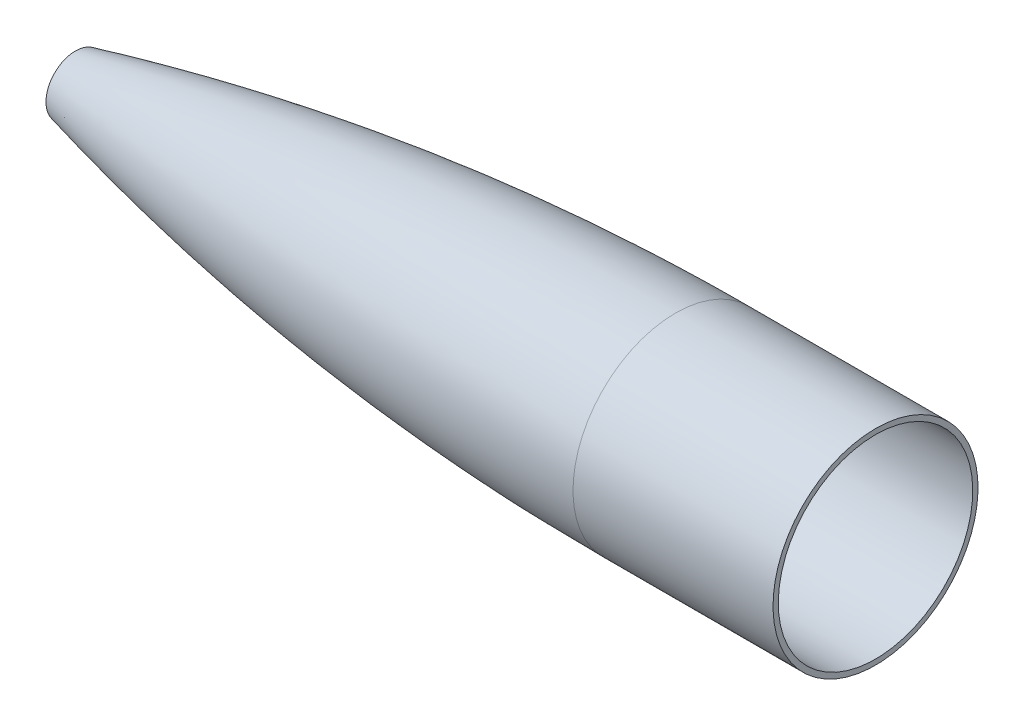
ISO-10303-21;
HEADER;
FILE_DESCRIPTION(('STEP AP214'),'2;1');
FILE_NAME('part.step','',(''),(''),'','','');
FILE_SCHEMA(('AUTOMOTIVE_DESIGN { 1 0 10303 214 1 1 1 1 }'));
ENDSEC;
DATA;
#1=APPLICATION_CONTEXT('core data for automotive mechanical design processes');
#2=APPLICATION_PROTOCOL_DEFINITION('international standard','automotive_design',2000,#1);
#3=PRODUCT_CONTEXT('',#1,'mechanical');
#4=PRODUCT('Part','Part','',(#3));
#5=PRODUCT_RELATED_PRODUCT_CATEGORY('part','',(#4));
#6=PRODUCT_DEFINITION_FORMATION('','',#4);
#7=PRODUCT_DEFINITION_CONTEXT('part definition',#1,'design');
#8=PRODUCT_DEFINITION('design','',#6,#7);
#9=PRODUCT_DEFINITION_SHAPE('','',#8);
#10=(LENGTH_UNIT() NAMED_UNIT(*) SI_UNIT(.MILLI.,.METRE.));
#11=(NAMED_UNIT(*) PLANE_ANGLE_UNIT() SI_UNIT($,.RADIAN.));
#12=(NAMED_UNIT(*) SI_UNIT($,.STERADIAN.) SOLID_ANGLE_UNIT());
#13=UNCERTAINTY_MEASURE_WITH_UNIT(LENGTH_MEASURE(1.E-05),#10,'distance_accuracy_value','');
#14=(GEOMETRIC_REPRESENTATION_CONTEXT(3) GLOBAL_UNCERTAINTY_ASSIGNED_CONTEXT((#13)) GLOBAL_UNIT_ASSIGNED_CONTEXT((#10,
#11,#12)) REPRESENTATION_CONTEXT('',''));
#15=CARTESIAN_POINT('',(0.,0.,0.));
#16=DIRECTION('',(0.,0.,1.));
#17=DIRECTION('',(1.,0.,0.));
#18=AXIS2_PLACEMENT_3D('',#15,#16,#17);
#19=CARTESIAN_POINT('',(304.800000031092,37.1184322765476,0.));
#20=CARTESIAN_POINT('',(304.362608568674,37.1184322765765,0.));
#21=CARTESIAN_POINT('',(303.482013872256,37.1178554777045,0.));
#22=CARTESIAN_POINT('',(301.605704892499,37.1152598826349,0.));
#23=CARTESIAN_POINT('',(299.544714424934,37.1083383050186,0.));
#24=CARTESIAN_POINT('',(297.472494410873,37.0979559621033,0.));
#25=CARTESIAN_POINT('',(295.363273175157,37.0841128821822,0.));
#26=CARTESIAN_POINT('',(293.269774242962,37.0668091029753,0.));
#27=CARTESIAN_POINT('',(291.173247601725,37.0460446716371,0.));
#28=CARTESIAN_POINT('',(288.529601771077,37.0154965272623,0.));
#29=CARTESIAN_POINT('',(285.339078018742,36.9715251890183,0.));
#30=CARTESIAN_POINT('',(281.601425943244,36.9095484034057,0.));
#31=CARTESIAN_POINT('',(277.316966571381,36.8240415080658,0.));
#32=CARTESIAN_POINT('',(273.032782612781,36.724078103407,0.));
#33=CARTESIAN_POINT('',(268.748981438034,36.6096593274611,0.));
#34=CARTESIAN_POINT('',(264.465578357243,36.4807864828461,0.));
#35=CARTESIAN_POINT('',(258.041173599329,36.2657983143029,0.));
#36=CARTESIAN_POINT('',(248.406459392085,35.8891249302461,0.));
#37=CARTESIAN_POINT('',(212.02240559919,34.1386627111653,0.));
#38=CARTESIAN_POINT('',(168.235004745408,30.3997734077008,0.));
#39=CARTESIAN_POINT('',(117.200757465518,23.8344737312111,0.));
#40=CARTESIAN_POINT('',(68.6856291196062,15.1354297288099,0.));
#41=CARTESIAN_POINT('',(46.6339897588963,10.667255189589,0.));
#42=CARTESIAN_POINT('',(31.979136177076,7.47409378510192,0.));
#43=CARTESIAN_POINT('',(26.7504413586006,6.31014235608259,0.));
#44=CARTESIAN_POINT('',(22.5706785618575,5.36487887198963,0.));
#45=CARTESIAN_POINT('',(18.9273951510021,4.52800833913857,0.));
#46=CARTESIAN_POINT('',(15.8195661268546,3.8049683464001,0.));
#47=CARTESIAN_POINT('',(13.2458559789221,3.20014893396907,0.));
#48=CARTESIAN_POINT('',(11.2056185557873,2.71713941225892,0.));
#49=CARTESIAN_POINT('',(9.16916740520237,2.2315011119499,0.));
#50=CARTESIAN_POINT('',(7.11820397784707,1.7387101129335,0.));
#51=CARTESIAN_POINT('',(5.10428972944912,1.25151369297217,0.));
#52=CARTESIAN_POINT('',(3.10131606158425,0.763457106588089,0.));
#53=CARTESIAN_POINT('',(1.2797480735425,0.315792439600321,0.));
#54=CARTESIAN_POINT('',(0.4246078184853,0.104973962160805,0.));
#55=CARTESIAN_POINT('',(2.86369595571545E-08,7.07978755509113E-09,0.));
#56=CARTESIAN_POINT('',(-0.62340940887639,-0.15412282310659,0.));
#57=CARTESIAN_POINT('',(-1.24681884638974,-0.308245653292968,0.));
#58=CARTESIAN_POINT('',(-1.87022828390309,-0.462368483479346,0.));
#59=CARTESIAN_POINT('',(-2.49363772141644,-0.616491313665723,0.));
#60=B_SPLINE_CURVE_WITH_KNOTS('',4,(#19,#20,#21,#22,#23,#24,#25,#26,#27,#28,#29,#30,#31,#32,#33,
#34,#35,#36,#37,#38,#39,#40,#41,#42,#43,#44,#45,#46,#47,#48,#49,#50,#51,#52,#53,#54,#55,#56,#57,
#58,#59),.UNSPECIFIED.,.F.,.F.,(5,1,1,1,1,1,1,1,1,1,1,1,1,1,1,1,1,1,1,1,1,1,1,1,1,1,1,1,1,1,1,1,
1,4,5),(0.0828265796838152,0.088510593669214,0.0941946077503887,0.0998786218315634,
0.105562635912738,0.111246649993913,0.116930664075087,0.122614678156262,0.128298692237437,
0.139917178797902,0.151535665358367,0.163154151918833,0.174772638479298,0.186391125158669,
0.198009611838039,0.20962809851741,0.244483558358007,0.290957504265252,0.593038155088685,
0.685986046714988,0.802170914122089,0.825407884970099,0.83702637262199,0.848644860273882,
0.860263347925774,0.871881835577666,0.877565849882412,0.883249864187158,0.888933878491904,
0.89461789279665,0.900301907101396,0.905985921406142,0.911669935710888,0.917353950116263,
0.925699223820588),.UNSPECIFIED.);
#61=CARTESIAN_POINT('',(304.800000001614,-14.9515677236317,0.));
#62=DIRECTION('',(1.,0.,0.));
#63=AXIS1_PLACEMENT('',#61,#62);
#64=SURFACE_OF_REVOLUTION('',#60,#63);
#65=CARTESIAN_POINT('',(0.,-14.9515677236318,0.));
#66=DIRECTION('',(1.,0.,0.));
#67=DIRECTION('',(0.,1.,0.));
#68=AXIS2_PLACEMENT_3D('',#65,#66,#67);
#69=CIRCLE('',#68,14.9515677236318);
#70=CARTESIAN_POINT('',(0.,0.,0.));
#71=VERTEX_POINT('',#70);
#72=EDGE_CURVE('E10',#71,#71,#69,.T.);
#73=ORIENTED_EDGE('',*,*,#72,.T.);
#74=EDGE_LOOP('',(#73));
#75=FACE_BOUND('',#74,.T.);
#76=CARTESIAN_POINT('',(304.800000001614,-14.9515677236317,0.));
#77=DIRECTION('',(1.,0.,0.));
#78=DIRECTION('',(0.,1.,0.));
#79=AXIS2_PLACEMENT_3D('',#76,#77,#78);
#80=CIRCLE('',#79,52.0699999999985);
#81=CARTESIAN_POINT('',(304.800000001614,37.1184322763667,0.));
#82=VERTEX_POINT('',#81);
#83=EDGE_CURVE('E48',#82,#82,#80,.T.);
#84=ORIENTED_EDGE('',*,*,#83,.F.);
#85=EDGE_LOOP('',(#84));
#86=FACE_BOUND('',#85,.T.);
#87=ADVANCED_FACE('F41',(#75,#86),#64,.F.);
#88=CARTESIAN_POINT('',(0.,0.,0.));
#89=DIRECTION('',(-1.,0.,0.));
#90=DIRECTION('',(0.,-1.,0.));
#91=AXIS2_PLACEMENT_3D('',#88,#89,#90);
#92=PLANE('',#91);
#93=CARTESIAN_POINT('',(0.,-14.9515677236318,0.));
#94=DIRECTION('',(1.,0.,0.));
#95=DIRECTION('',(0.,1.,0.));
#96=AXIS2_PLACEMENT_3D('',#93,#94,#95);
#97=CIRCLE('',#96,12.5967429975681);
#98=CARTESIAN_POINT('',(0.,-2.35482472606368,0.));
#99=VERTEX_POINT('',#98);
#100=EDGE_CURVE('E52',#99,#99,#97,.T.);
#101=ORIENTED_EDGE('',*,*,#100,.T.);
#102=EDGE_LOOP('',(#101));
#103=FACE_BOUND('',#102,.T.);
#104=ORIENTED_EDGE('',*,*,#72,.F.);
#105=EDGE_LOOP('',(#104));
#106=FACE_BOUND('',#105,.T.);
#107=ADVANCED_FACE('F43',(#103,#106),#92,.T.);
#108=CARTESIAN_POINT('',(304.800000031092,37.1184322765476,0.));
#109=CARTESIAN_POINT('',(304.362608568674,37.1184322765765,0.));
#110=CARTESIAN_POINT('',(303.482013872256,37.1178554777045,0.));
#111=CARTESIAN_POINT('',(301.605704892499,37.1152598826349,0.));
#112=CARTESIAN_POINT('',(299.544714424934,37.1083383050186,0.));
#113=CARTESIAN_POINT('',(297.472494410873,37.0979559621033,0.));
#114=CARTESIAN_POINT('',(295.363273175157,37.0841128821822,0.));
#115=CARTESIAN_POINT('',(293.269774242962,37.0668091029753,0.));
#116=CARTESIAN_POINT('',(291.173247601725,37.0460446716371,0.));
#117=CARTESIAN_POINT('',(288.529601771077,37.0154965272623,0.));
#118=CARTESIAN_POINT('',(285.339078018742,36.9715251890183,0.));
#119=CARTESIAN_POINT('',(281.601425943244,36.9095484034057,0.));
#120=CARTESIAN_POINT('',(277.316966571381,36.8240415080658,0.));
#121=CARTESIAN_POINT('',(273.032782612781,36.724078103407,0.));
#122=CARTESIAN_POINT('',(268.748981438034,36.6096593274611,0.));
#123=CARTESIAN_POINT('',(264.465578357243,36.4807864828461,0.));
#124=CARTESIAN_POINT('',(258.041173599329,36.2657983143029,0.));
#125=CARTESIAN_POINT('',(248.406459392085,35.8891249302461,0.));
#126=CARTESIAN_POINT('',(212.02240559919,34.1386627111653,0.));
#127=CARTESIAN_POINT('',(168.235004745408,30.3997734077008,0.));
#128=CARTESIAN_POINT('',(117.200757465518,23.8344737312111,0.));
#129=CARTESIAN_POINT('',(68.6856291196062,15.1354297288099,0.));
#130=CARTESIAN_POINT('',(46.6339897588963,10.667255189589,0.));
#131=CARTESIAN_POINT('',(31.979136177076,7.47409378510192,0.));
#132=CARTESIAN_POINT('',(26.7504413586006,6.31014235608259,0.));
#133=CARTESIAN_POINT('',(22.5706785618575,5.36487887198963,0.));
#134=CARTESIAN_POINT('',(18.9273951510021,4.52800833913857,0.));
#135=CARTESIAN_POINT('',(15.8195661268546,3.8049683464001,0.));
#136=CARTESIAN_POINT('',(13.2458559789221,3.20014893396907,0.));
#137=CARTESIAN_POINT('',(11.2056185557873,2.71713941225892,0.));
#138=CARTESIAN_POINT('',(9.16916740520237,2.2315011119499,0.));
#139=CARTESIAN_POINT('',(7.11820397784707,1.7387101129335,0.));
#140=CARTESIAN_POINT('',(5.10428972944912,1.25151369297217,0.));
#141=CARTESIAN_POINT('',(3.10131606158425,0.763457106588089,0.));
#142=CARTESIAN_POINT('',(1.2797480735425,0.315792439600321,0.));
#143=CARTESIAN_POINT('',(0.4246078184853,0.104973962160805,0.));
#144=CARTESIAN_POINT('',(-0.62340940887639,-0.15412282310659,0.));
#145=CARTESIAN_POINT('',(-1.24681884638974,-0.308245653292968,0.));
#146=CARTESIAN_POINT('',(-1.87022828390309,-0.462368483479346,0.));
#147=CARTESIAN_POINT('',(-2.49363772141644,-0.616491313665723,0.));
#148=B_SPLINE_CURVE_WITH_KNOTS('',4,(#108,#109,#110,#111,#112,#113,#114,#115,#116,#117,#118,
#119,#120,#121,#122,#123,#124,#125,#126,#127,#128,#129,#130,#131,#132,#133,#134,#135,#136,#137,
#138,#139,#140,#141,#142,#143,#144,#145,#146,#147),.UNSPECIFIED.,.F.,.F.,(5,1,1,1,1,1,1,1,1,1,1,
1,1,1,1,1,1,1,1,1,1,1,1,1,1,1,1,1,1,1,1,1,1,3,5),(0.0828265796838152,0.088510593669214,
0.0941946077503887,0.0998786218315634,0.105562635912738,0.111246649993913,0.116930664075087,
0.122614678156262,0.128298692237437,0.139917178797902,0.151535665358367,0.163154151918833,
0.174772638479298,0.186391125158669,0.198009611838039,0.20962809851741,0.244483558358007,
0.290957504265252,0.593038155088685,0.685986046714988,0.802170914122089,0.825407884970099,
0.83702637262199,0.848644860273882,0.860263347925774,0.871881835577666,0.877565849882412,
0.883249864187158,0.888933878491904,0.89461789279665,0.900301907101396,0.905985921406142,
0.911669935710888,0.917353950116263,0.925699223820588),.UNSPECIFIED.);
#149=CARTESIAN_POINT('',(304.800000001614,-14.9515677236317,0.));
#150=DIRECTION('',(1.,0.,0.));
#151=AXIS1_PLACEMENT('',#149,#150);
#152=SURFACE_OF_REVOLUTION('',#148,#151);
#153=OFFSET_SURFACE('',#152,2.286,.F.);
#154=ORIENTED_EDGE('',*,*,#100,.F.);
#155=EDGE_LOOP('',(#154));
#156=FACE_BOUND('',#155,.T.);
#157=CARTESIAN_POINT('',(304.800000030941,-14.9515677236317,0.));
#158=DIRECTION('',(1.,0.,0.));
#159=DIRECTION('',(0.,1.,0.));
#160=AXIS2_PLACEMENT_3D('',#157,#158,#159);
#161=CIRCLE('',#160,49.7840000001793);
#162=CARTESIAN_POINT('',(304.800000030941,34.8324322765476,0.));
#163=VERTEX_POINT('',#162);
#164=EDGE_CURVE('E56',#163,#163,#161,.F.);
#165=ORIENTED_EDGE('',*,*,#164,.F.);
#166=EDGE_LOOP('',(#165));
#167=FACE_BOUND('',#166,.T.);
#168=ADVANCED_FACE('F69',(#156,#167),#153,.T.);
#169=CARTESIAN_POINT('',(304.800000001614,-14.9515677236317,0.));
#170=DIRECTION('',(1.,0.,0.));
#171=DIRECTION('',(0.,1.,0.));
#172=AXIS2_PLACEMENT_3D('',#169,#170,#171);
#173=PLANE('',#172);
#174=CARTESIAN_POINT('',(304.800000001614,-14.9515677236317,0.));
#175=DIRECTION('',(1.,0.,0.));
#176=DIRECTION('',(0.,1.,0.));
#177=AXIS2_PLACEMENT_3D('',#174,#175,#176);
#178=CIRCLE('',#177,49.3903);
#179=CARTESIAN_POINT('',(304.800000001614,34.4387322763683,0.));
#180=VERTEX_POINT('',#179);
#181=EDGE_CURVE('E96',#180,#180,#178,.T.);
#182=ORIENTED_EDGE('',*,*,#181,.T.);
#183=EDGE_LOOP('',(#182));
#184=FACE_BOUND('',#183,.T.);
#185=ORIENTED_EDGE('',*,*,#164,.T.);
#186=EDGE_LOOP('',(#185));
#187=FACE_BOUND('',#186,.T.);
#188=ADVANCED_FACE('F72',(#184,#187),#173,.F.);
#189=CARTESIAN_POINT('',(406.400000001614,-14.9515677236317,0.));
#190=DIRECTION('',(1.,0.,0.));
#191=DIRECTION('',(0.,1.,0.));
#192=AXIS2_PLACEMENT_3D('',#189,#190,#191);
#193=PLANE('',#192);
#194=CARTESIAN_POINT('',(406.400000001614,-14.9515677236317,0.));
#195=DIRECTION('',(1.,0.,0.));
#196=DIRECTION('',(0.,1.,0.));
#197=AXIS2_PLACEMENT_3D('',#194,#195,#196);
#198=CIRCLE('',#197,52.07);
#199=CARTESIAN_POINT('',(406.400000001614,37.1184322763683,0.));
#200=VERTEX_POINT('',#199);
#201=EDGE_CURVE('E98',#200,#200,#198,.T.);
#202=ORIENTED_EDGE('',*,*,#201,.T.);
#203=EDGE_LOOP('',(#202));
#204=FACE_BOUND('',#203,.T.);
#205=CARTESIAN_POINT('',(406.400000001614,-14.9515677236317,0.));
#206=DIRECTION('',(1.,0.,0.));
#207=DIRECTION('',(0.,1.,0.));
#208=AXIS2_PLACEMENT_3D('',#205,#206,#207);
#209=CIRCLE('',#208,49.3903);
#210=CARTESIAN_POINT('',(406.400000001614,34.4387322763683,0.));
#211=VERTEX_POINT('',#210);
#212=EDGE_CURVE('E93',#211,#211,#209,.T.);
#213=ORIENTED_EDGE('',*,*,#212,.F.);
#214=EDGE_LOOP('',(#213));
#215=FACE_BOUND('',#214,.T.);
#216=ADVANCED_FACE('F78',(#204,#215),#193,.T.);
#217=CARTESIAN_POINT('',(406.400000001614,-14.9515677236317,0.));
#218=DIRECTION('',(-1.,0.,0.));
#219=DIRECTION('',(0.,-1.,0.));
#220=AXIS2_PLACEMENT_3D('',#217,#218,#219);
#221=CYLINDRICAL_SURFACE('',#220,52.07);
#222=ORIENTED_EDGE('',*,*,#201,.F.);
#223=EDGE_LOOP('',(#222));
#224=FACE_BOUND('',#223,.T.);
#225=ORIENTED_EDGE('',*,*,#83,.T.);
#226=EDGE_LOOP('',(#225));
#227=FACE_BOUND('',#226,.T.);
#228=ADVANCED_FACE('F74',(#224,#227),#221,.T.);
#229=CARTESIAN_POINT('',(406.400000001614,-14.9515677236317,0.));
#230=DIRECTION('',(-1.,0.,0.));
#231=DIRECTION('',(0.,-1.,0.));
#232=AXIS2_PLACEMENT_3D('',#229,#230,#231);
#233=CYLINDRICAL_SURFACE('',#232,49.3903);
#234=ORIENTED_EDGE('',*,*,#212,.T.);
#235=EDGE_LOOP('',(#234));
#236=FACE_BOUND('',#235,.T.);
#237=ORIENTED_EDGE('',*,*,#181,.F.);
#238=EDGE_LOOP('',(#237));
#239=FACE_BOUND('',#238,.T.);
#240=ADVANCED_FACE('F77',(#236,#239),#233,.F.);
#241=CLOSED_SHELL('',(#87,#107,#168,#188,#216,#228,#240));
#242=MANIFOLD_SOLID_BREP('B2',#241);
#243=ADVANCED_BREP_SHAPE_REPRESENTATION('',(#18,#242),#14);
#244=SHAPE_DEFINITION_REPRESENTATION(#9,#243);
ENDSEC;
END-ISO-10303-21;
